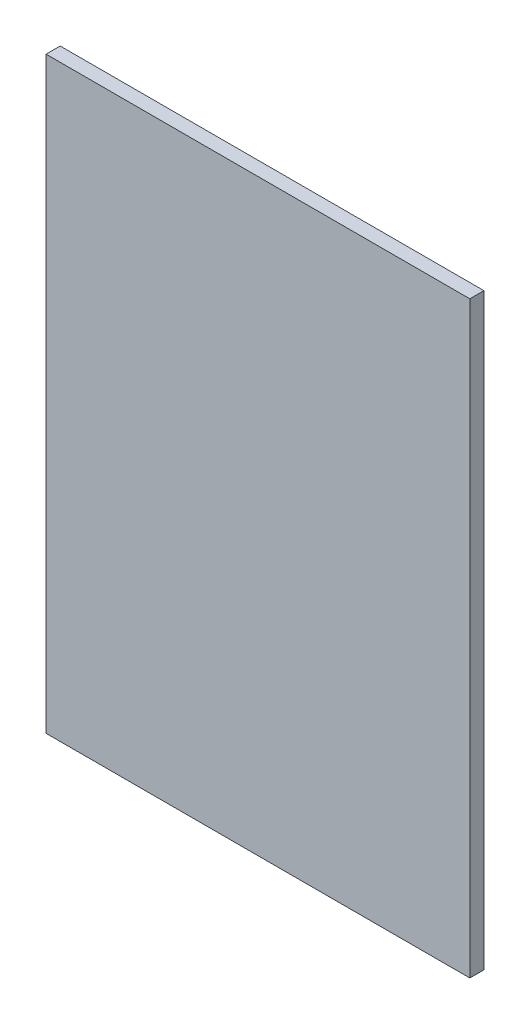
ISO-10303-21;
HEADER;
FILE_DESCRIPTION(('STEP AP214'),'2;1');
FILE_NAME('part.step','',(''),(''),'','','');
FILE_SCHEMA(('AUTOMOTIVE_DESIGN { 1 0 10303 214 1 1 1 1 }'));
ENDSEC;
DATA;
#1=APPLICATION_CONTEXT('core data for automotive mechanical design processes');
#2=APPLICATION_PROTOCOL_DEFINITION('international standard','automotive_design',2000,#1);
#3=PRODUCT_CONTEXT('',#1,'mechanical');
#4=PRODUCT('Part','Part','',(#3));
#5=PRODUCT_RELATED_PRODUCT_CATEGORY('part','',(#4));
#6=PRODUCT_DEFINITION_FORMATION('','',#4);
#7=PRODUCT_DEFINITION_CONTEXT('part definition',#1,'design');
#8=PRODUCT_DEFINITION('design','',#6,#7);
#9=PRODUCT_DEFINITION_SHAPE('','',#8);
#10=(LENGTH_UNIT() NAMED_UNIT(*) SI_UNIT(.MILLI.,.METRE.));
#11=(NAMED_UNIT(*) PLANE_ANGLE_UNIT() SI_UNIT($,.RADIAN.));
#12=(NAMED_UNIT(*) SI_UNIT($,.STERADIAN.) SOLID_ANGLE_UNIT());
#13=UNCERTAINTY_MEASURE_WITH_UNIT(LENGTH_MEASURE(1.E-05),#10,'distance_accuracy_value','');
#14=(GEOMETRIC_REPRESENTATION_CONTEXT(3) GLOBAL_UNCERTAINTY_ASSIGNED_CONTEXT((#13)) GLOBAL_UNIT_ASSIGNED_CONTEXT((#10,
#11,#12)) REPRESENTATION_CONTEXT('',''));
#15=CARTESIAN_POINT('',(0.,0.,0.));
#16=DIRECTION('',(0.,0.,1.));
#17=DIRECTION('',(1.,0.,0.));
#18=AXIS2_PLACEMENT_3D('',#15,#16,#17);
#19=CARTESIAN_POINT('',(-348.542768427691,449.688501791934,10.));
#20=DIRECTION('',(1.,0.,0.));
#21=DIRECTION('',(0.,0.,-1.));
#22=AXIS2_PLACEMENT_3D('',#19,#20,#21);
#23=PLANE('',#22);
#24=DIRECTION('',(0.,-1.,0.));
#25=VECTOR('',#24,1.);
#26=CARTESIAN_POINT('',(-348.542768427691,449.688501791934,0.));
#27=LINE('',#26,#25);
#28=CARTESIAN_POINT('',(-348.542768427691,449.688501791934,0.));
#29=VERTEX_POINT('',#28);
#30=CARTESIAN_POINT('',(-348.542768427691,33.2611706799391,0.));
#31=VERTEX_POINT('',#30);
#32=EDGE_CURVE('E98',#29,#31,#27,.T.);
#33=ORIENTED_EDGE('',*,*,#32,.T.);
#34=DIRECTION('',(0.,0.,-1.));
#35=VECTOR('',#34,1.);
#36=CARTESIAN_POINT('',(-348.542768427691,33.2611706799391,10.));
#37=LINE('',#36,#35);
#38=CARTESIAN_POINT('',(-348.542768427691,33.2611706799391,10.));
#39=VERTEX_POINT('',#38);
#40=EDGE_CURVE('E11',#39,#31,#37,.T.);
#41=ORIENTED_EDGE('',*,*,#40,.F.);
#42=DIRECTION('',(0.,-1.,0.));
#43=VECTOR('',#42,1.);
#44=CARTESIAN_POINT('',(-348.542768427691,449.688501791934,10.));
#45=LINE('',#44,#43);
#46=CARTESIAN_POINT('',(-348.542768427691,449.688501791934,10.));
#47=VERTEX_POINT('',#46);
#48=EDGE_CURVE('E86',#47,#39,#45,.T.);
#49=ORIENTED_EDGE('',*,*,#48,.F.);
#50=DIRECTION('',(0.,0.,-1.));
#51=VECTOR('',#50,1.);
#52=CARTESIAN_POINT('',(-348.542768427691,449.688501791934,10.));
#53=LINE('',#52,#51);
#54=EDGE_CURVE('E94',#47,#29,#53,.T.);
#55=ORIENTED_EDGE('',*,*,#54,.T.);
#56=EDGE_LOOP('',(#33,#41,#49,#55));
#57=FACE_BOUND('',#56,.T.);
#58=ADVANCED_FACE('F35',(#57),#23,.F.);
#59=CARTESIAN_POINT('',(-348.542768427691,33.2611706799391,10.));
#60=DIRECTION('',(0.,1.,0.));
#61=DIRECTION('',(0.,0.,1.));
#62=AXIS2_PLACEMENT_3D('',#59,#60,#61);
#63=PLANE('',#62);
#64=DIRECTION('',(1.,0.,0.));
#65=VECTOR('',#64,1.);
#66=CARTESIAN_POINT('',(-348.542768427691,33.2611706799391,0.));
#67=LINE('',#66,#65);
#68=CARTESIAN_POINT('',(-48.5427684276914,33.2611706799391,0.));
#69=VERTEX_POINT('',#68);
#70=EDGE_CURVE('E90',#31,#69,#67,.T.);
#71=ORIENTED_EDGE('',*,*,#70,.T.);
#72=DIRECTION('',(0.,0.,-1.));
#73=VECTOR('',#72,1.);
#74=CARTESIAN_POINT('',(-48.5427684276914,33.2611706799391,10.));
#75=LINE('',#74,#73);
#76=CARTESIAN_POINT('',(-48.5427684276914,33.2611706799391,10.));
#77=VERTEX_POINT('',#76);
#78=EDGE_CURVE('E43',#77,#69,#75,.T.);
#79=ORIENTED_EDGE('',*,*,#78,.F.);
#80=DIRECTION('',(1.,0.,0.));
#81=VECTOR('',#80,1.);
#82=CARTESIAN_POINT('',(-348.542768427691,33.2611706799391,10.));
#83=LINE('',#82,#81);
#84=EDGE_CURVE('E81',#39,#77,#83,.T.);
#85=ORIENTED_EDGE('',*,*,#84,.F.);
#86=ORIENTED_EDGE('',*,*,#40,.T.);
#87=EDGE_LOOP('',(#71,#79,#85,#86));
#88=FACE_BOUND('',#87,.T.);
#89=ADVANCED_FACE('F89',(#88),#63,.F.);
#90=CARTESIAN_POINT('',(-48.5427684276914,33.2611706799391,10.));
#91=DIRECTION('',(-1.,0.,0.));
#92=DIRECTION('',(0.,0.,1.));
#93=AXIS2_PLACEMENT_3D('',#90,#91,#92);
#94=PLANE('',#93);
#95=DIRECTION('',(0.,1.,0.));
#96=VECTOR('',#95,1.);
#97=CARTESIAN_POINT('',(-48.5427684276914,33.2611706799391,0.));
#98=LINE('',#97,#96);
#99=CARTESIAN_POINT('',(-48.5427684276914,449.688501791934,0.));
#100=VERTEX_POINT('',#99);
#101=EDGE_CURVE('E68',#69,#100,#98,.T.);
#102=ORIENTED_EDGE('',*,*,#101,.T.);
#103=DIRECTION('',(0.,0.,-1.));
#104=VECTOR('',#103,1.);
#105=CARTESIAN_POINT('',(-48.5427684276914,449.688501791934,10.));
#106=LINE('',#105,#104);
#107=CARTESIAN_POINT('',(-48.5427684276914,449.688501791934,10.));
#108=VERTEX_POINT('',#107);
#109=EDGE_CURVE('E91',#108,#100,#106,.T.);
#110=ORIENTED_EDGE('',*,*,#109,.F.);
#111=DIRECTION('',(0.,1.,0.));
#112=VECTOR('',#111,1.);
#113=CARTESIAN_POINT('',(-48.5427684276914,33.2611706799391,10.));
#114=LINE('',#113,#112);
#115=EDGE_CURVE('E84',#77,#108,#114,.T.);
#116=ORIENTED_EDGE('',*,*,#115,.F.);
#117=ORIENTED_EDGE('',*,*,#78,.T.);
#118=EDGE_LOOP('',(#102,#110,#116,#117));
#119=FACE_BOUND('',#118,.T.);
#120=ADVANCED_FACE('F92',(#119),#94,.F.);
#121=CARTESIAN_POINT('',(-48.5427684276914,449.688501791934,10.));
#122=DIRECTION('',(0.,-1.,0.));
#123=DIRECTION('',(1.,0.,0.));
#124=AXIS2_PLACEMENT_3D('',#121,#122,#123);
#125=PLANE('',#124);
#126=DIRECTION('',(-1.,0.,0.));
#127=VECTOR('',#126,1.);
#128=CARTESIAN_POINT('',(-48.5427684276914,449.688501791934,0.));
#129=LINE('',#128,#127);
#130=EDGE_CURVE('E74',#100,#29,#129,.T.);
#131=ORIENTED_EDGE('',*,*,#130,.T.);
#132=ORIENTED_EDGE('',*,*,#54,.F.);
#133=DIRECTION('',(-1.,0.,0.));
#134=VECTOR('',#133,1.);
#135=CARTESIAN_POINT('',(-48.5427684276914,449.688501791934,10.));
#136=LINE('',#135,#134);
#137=EDGE_CURVE('E51',#108,#47,#136,.T.);
#138=ORIENTED_EDGE('',*,*,#137,.F.);
#139=ORIENTED_EDGE('',*,*,#109,.T.);
#140=EDGE_LOOP('',(#131,#132,#138,#139));
#141=FACE_BOUND('',#140,.T.);
#142=ADVANCED_FACE('F105',(#141),#125,.F.);
#143=CARTESIAN_POINT('',(0.,0.,10.));
#144=DIRECTION('',(0.,0.,1.));
#145=DIRECTION('',(1.,0.,0.));
#146=AXIS2_PLACEMENT_3D('',#143,#144,#145);
#147=PLANE('',#146);
#148=ORIENTED_EDGE('',*,*,#48,.T.);
#149=ORIENTED_EDGE('',*,*,#84,.T.);
#150=ORIENTED_EDGE('',*,*,#115,.T.);
#151=ORIENTED_EDGE('',*,*,#137,.T.);
#152=EDGE_LOOP('',(#148,#149,#150,#151));
#153=FACE_BOUND('',#152,.T.);
#154=ADVANCED_FACE('F82',(#153),#147,.T.);
#155=CARTESIAN_POINT('',(0.,0.,0.));
#156=DIRECTION('',(0.,0.,1.));
#157=DIRECTION('',(1.,0.,0.));
#158=AXIS2_PLACEMENT_3D('',#155,#156,#157);
#159=PLANE('',#158);
#160=ORIENTED_EDGE('',*,*,#32,.F.);
#161=ORIENTED_EDGE('',*,*,#130,.F.);
#162=ORIENTED_EDGE('',*,*,#101,.F.);
#163=ORIENTED_EDGE('',*,*,#70,.F.);
#164=EDGE_LOOP('',(#160,#161,#162,#163));
#165=FACE_BOUND('',#164,.T.);
#166=ADVANCED_FACE('F108',(#165),#159,.F.);
#167=CLOSED_SHELL('',(#58,#89,#120,#142,#154,#166));
#168=MANIFOLD_SOLID_BREP('B2',#167);
#169=ADVANCED_BREP_SHAPE_REPRESENTATION('',(#18,#168),#14);
#170=SHAPE_DEFINITION_REPRESENTATION(#9,#169);
ENDSEC;
END-ISO-10303-21;
